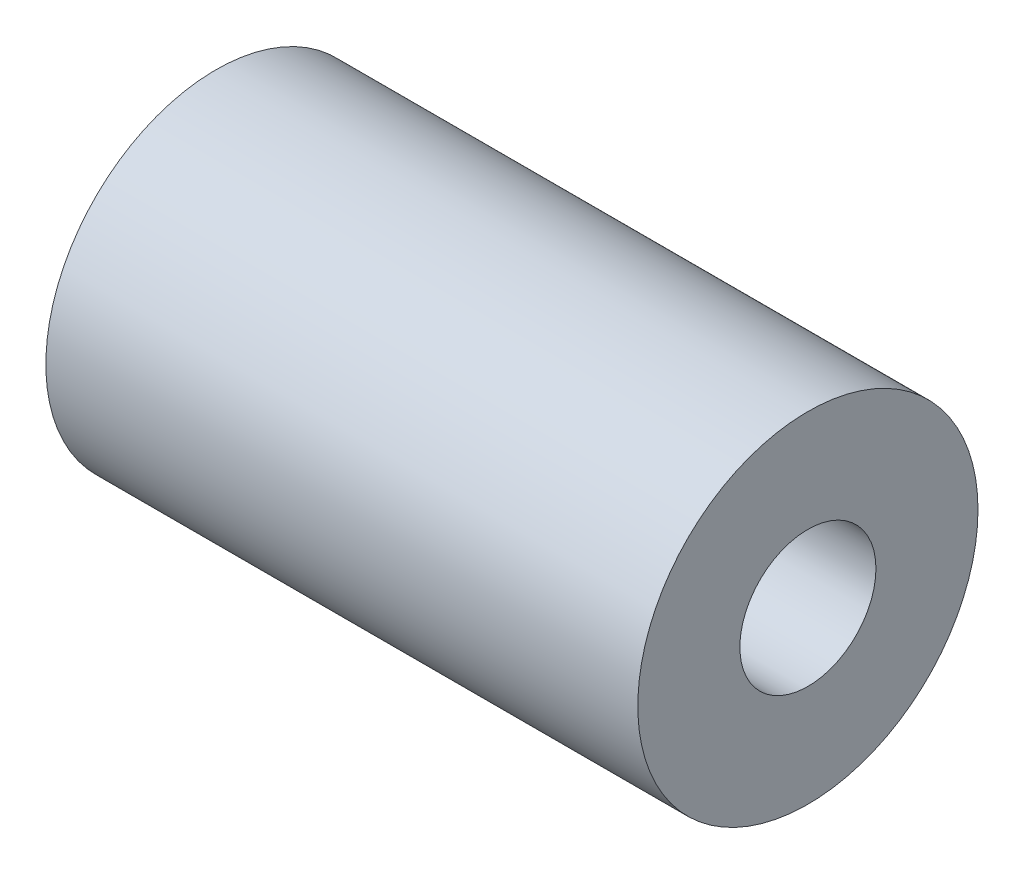
ISO-10303-21;
HEADER;
FILE_DESCRIPTION(('STEP AP214'),'2;1');
FILE_NAME('part.step','',(''),(''),'','','');
FILE_SCHEMA(('AUTOMOTIVE_DESIGN { 1 0 10303 214 1 1 1 1 }'));
ENDSEC;
DATA;
#1=APPLICATION_CONTEXT('core data for automotive mechanical design processes');
#2=APPLICATION_PROTOCOL_DEFINITION('international standard','automotive_design',2000,#1);
#3=PRODUCT_CONTEXT('',#1,'mechanical');
#4=PRODUCT('Part','Part','',(#3));
#5=PRODUCT_RELATED_PRODUCT_CATEGORY('part','',(#4));
#6=PRODUCT_DEFINITION_FORMATION('','',#4);
#7=PRODUCT_DEFINITION_CONTEXT('part definition',#1,'design');
#8=PRODUCT_DEFINITION('design','',#6,#7);
#9=PRODUCT_DEFINITION_SHAPE('','',#8);
#10=(LENGTH_UNIT() NAMED_UNIT(*) SI_UNIT(.MILLI.,.METRE.));
#11=(NAMED_UNIT(*) PLANE_ANGLE_UNIT() SI_UNIT($,.RADIAN.));
#12=(NAMED_UNIT(*) SI_UNIT($,.STERADIAN.) SOLID_ANGLE_UNIT());
#13=UNCERTAINTY_MEASURE_WITH_UNIT(LENGTH_MEASURE(1.E-05),#10,'distance_accuracy_value','');
#14=(GEOMETRIC_REPRESENTATION_CONTEXT(3) GLOBAL_UNCERTAINTY_ASSIGNED_CONTEXT((#13)) GLOBAL_UNIT_ASSIGNED_CONTEXT((#10,
#11,#12)) REPRESENTATION_CONTEXT('',''));
#15=CARTESIAN_POINT('',(0.,0.,0.));
#16=DIRECTION('',(0.,0.,1.));
#17=DIRECTION('',(1.,0.,0.));
#18=AXIS2_PLACEMENT_3D('',#15,#16,#17);
#19=CARTESIAN_POINT('',(-1.52791332641481E-13,25.,0.));
#20=DIRECTION('',(-1.,0.,0.));
#21=DIRECTION('',(0.,0.,1.));
#22=AXIS2_PLACEMENT_3D('',#19,#20,#21);
#23=PLANE('',#22);
#24=CARTESIAN_POINT('',(0.,0.,0.));
#25=DIRECTION('',(1.,0.,0.));
#26=DIRECTION('',(0.,0.,-1.));
#27=AXIS2_PLACEMENT_3D('',#24,#25,#26);
#28=CIRCLE('',#27,10.);
#29=CARTESIAN_POINT('',(0.,0.,-10.));
#30=VERTEX_POINT('',#29);
#31=EDGE_CURVE('E10',#30,#30,#28,.T.);
#32=ORIENTED_EDGE('',*,*,#31,.T.);
#33=EDGE_LOOP('',(#32));
#34=FACE_BOUND('',#33,.T.);
#35=CARTESIAN_POINT('',(-3.05582665282962E-13,0.,0.));
#36=DIRECTION('',(1.,0.,0.));
#37=DIRECTION('',(0.,0.,-1.));
#38=AXIS2_PLACEMENT_3D('',#35,#36,#37);
#39=CIRCLE('',#38,25.);
#40=CARTESIAN_POINT('',(-3.05582665282962E-13,0.,-25.));
#41=VERTEX_POINT('',#40);
#42=EDGE_CURVE('E51',#41,#41,#39,.T.);
#43=ORIENTED_EDGE('',*,*,#42,.F.);
#44=EDGE_LOOP('',(#43));
#45=FACE_BOUND('',#44,.T.);
#46=ADVANCED_FACE('F37',(#34,#45),#23,.T.);
#47=CARTESIAN_POINT('',(0.,0.,0.));
#48=DIRECTION('',(1.,0.,0.));
#49=DIRECTION('',(0.,0.,-1.));
#50=AXIS2_PLACEMENT_3D('',#47,#48,#49);
#51=CYLINDRICAL_SURFACE('',#50,10.);
#52=CARTESIAN_POINT('',(86.9999999999997,0.,0.));
#53=DIRECTION('',(1.,0.,0.));
#54=DIRECTION('',(0.,0.,-1.));
#55=AXIS2_PLACEMENT_3D('',#52,#53,#54);
#56=CIRCLE('',#55,10.);
#57=CARTESIAN_POINT('',(86.9999999999997,0.,-10.));
#58=VERTEX_POINT('',#57);
#59=EDGE_CURVE('E43',#58,#58,#56,.T.);
#60=ORIENTED_EDGE('',*,*,#59,.T.);
#61=EDGE_LOOP('',(#60));
#62=FACE_BOUND('',#61,.T.);
#63=ORIENTED_EDGE('',*,*,#31,.F.);
#64=EDGE_LOOP('',(#63));
#65=FACE_BOUND('',#64,.T.);
#66=ADVANCED_FACE('F61',(#62,#65),#51,.F.);
#67=CARTESIAN_POINT('',(86.9999999999997,25.,0.));
#68=DIRECTION('',(1.,0.,0.));
#69=DIRECTION('',(0.,0.,-1.));
#70=AXIS2_PLACEMENT_3D('',#67,#68,#69);
#71=PLANE('',#70);
#72=CARTESIAN_POINT('',(86.9999999999997,0.,0.));
#73=DIRECTION('',(1.,0.,0.));
#74=DIRECTION('',(0.,0.,-1.));
#75=AXIS2_PLACEMENT_3D('',#72,#73,#74);
#76=CIRCLE('',#75,25.);
#77=CARTESIAN_POINT('',(86.9999999999997,0.,-25.));
#78=VERTEX_POINT('',#77);
#79=EDGE_CURVE('E47',#78,#78,#76,.T.);
#80=ORIENTED_EDGE('',*,*,#79,.T.);
#81=EDGE_LOOP('',(#80));
#82=FACE_BOUND('',#81,.T.);
#83=ORIENTED_EDGE('',*,*,#59,.F.);
#84=EDGE_LOOP('',(#83));
#85=FACE_BOUND('',#84,.T.);
#86=ADVANCED_FACE('F65',(#82,#85),#71,.T.);
#87=CARTESIAN_POINT('',(0.,0.,0.));
#88=DIRECTION('',(1.,0.,0.));
#89=DIRECTION('',(0.,0.,-1.));
#90=AXIS2_PLACEMENT_3D('',#87,#88,#89);
#91=CYLINDRICAL_SURFACE('',#90,25.);
#92=ORIENTED_EDGE('',*,*,#42,.T.);
#93=EDGE_LOOP('',(#92));
#94=FACE_BOUND('',#93,.T.);
#95=ORIENTED_EDGE('',*,*,#79,.F.);
#96=EDGE_LOOP('',(#95));
#97=FACE_BOUND('',#96,.T.);
#98=ADVANCED_FACE('F57',(#94,#97),#91,.T.);
#99=CLOSED_SHELL('',(#46,#66,#86,#98));
#100=MANIFOLD_SOLID_BREP('B2',#99);
#101=ADVANCED_BREP_SHAPE_REPRESENTATION('',(#18,#100),#14);
#102=SHAPE_DEFINITION_REPRESENTATION(#9,#101);
ENDSEC;
END-ISO-10303-21;
